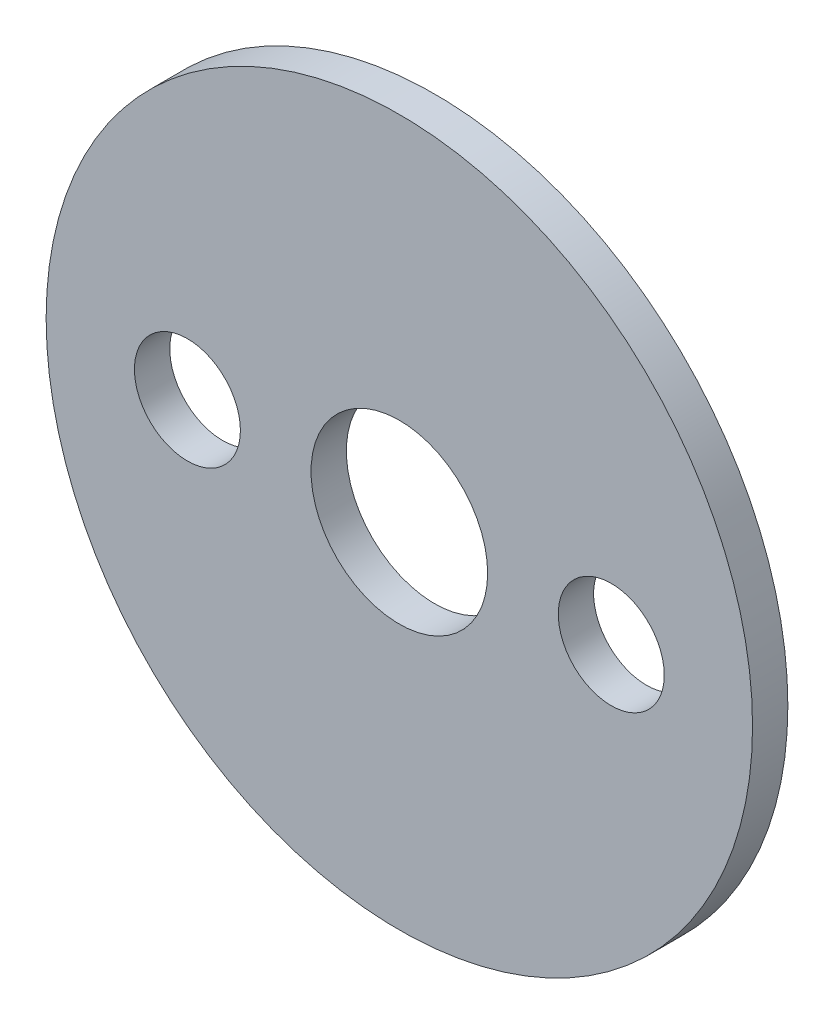
ISO-10303-21;
HEADER;
FILE_DESCRIPTION(('STEP AP214'),'2;1');
FILE_NAME('part.step','',(''),(''),'','','');
FILE_SCHEMA(('AUTOMOTIVE_DESIGN { 1 0 10303 214 1 1 1 1 }'));
ENDSEC;
DATA;
#1=APPLICATION_CONTEXT('core data for automotive mechanical design processes');
#2=APPLICATION_PROTOCOL_DEFINITION('international standard','automotive_design',2000,#1);
#3=PRODUCT_CONTEXT('',#1,'mechanical');
#4=PRODUCT('Part','Part','',(#3));
#5=PRODUCT_RELATED_PRODUCT_CATEGORY('part','',(#4));
#6=PRODUCT_DEFINITION_FORMATION('','',#4);
#7=PRODUCT_DEFINITION_CONTEXT('part definition',#1,'design');
#8=PRODUCT_DEFINITION('design','',#6,#7);
#9=PRODUCT_DEFINITION_SHAPE('','',#8);
#10=(LENGTH_UNIT() NAMED_UNIT(*) SI_UNIT(.MILLI.,.METRE.));
#11=(NAMED_UNIT(*) PLANE_ANGLE_UNIT() SI_UNIT($,.RADIAN.));
#12=(NAMED_UNIT(*) SI_UNIT($,.STERADIAN.) SOLID_ANGLE_UNIT());
#13=UNCERTAINTY_MEASURE_WITH_UNIT(LENGTH_MEASURE(1.E-05),#10,'distance_accuracy_value','');
#14=(GEOMETRIC_REPRESENTATION_CONTEXT(3) GLOBAL_UNCERTAINTY_ASSIGNED_CONTEXT((#13)) GLOBAL_UNIT_ASSIGNED_CONTEXT((#10,
#11,#12)) REPRESENTATION_CONTEXT('',''));
#15=CARTESIAN_POINT('',(0.,0.,0.));
#16=DIRECTION('',(0.,0.,1.));
#17=DIRECTION('',(1.,0.,0.));
#18=AXIS2_PLACEMENT_3D('',#15,#16,#17);
#19=CARTESIAN_POINT('',(0.,0.,0.25));
#20=DIRECTION('',(0.,0.,1.));
#21=DIRECTION('',(1.,0.,0.));
#22=AXIS2_PLACEMENT_3D('',#19,#20,#21);
#23=PLANE('',#22);
#24=CARTESIAN_POINT('',(-1.5,0.,0.25));
#25=DIRECTION('',(0.,0.,1.));
#26=DIRECTION('',(1.,0.,0.));
#27=AXIS2_PLACEMENT_3D('',#24,#25,#26);
#28=CIRCLE('',#27,0.375);
#29=CARTESIAN_POINT('',(-1.125,0.,0.25));
#30=VERTEX_POINT('',#29);
#31=EDGE_CURVE('E63',#30,#30,#28,.T.);
#32=ORIENTED_EDGE('',*,*,#31,.F.);
#33=EDGE_LOOP('',(#32));
#34=FACE_BOUND('',#33,.T.);
#35=CARTESIAN_POINT('',(1.5,0.,0.25));
#36=DIRECTION('',(0.,0.,1.));
#37=DIRECTION('',(1.,0.,0.));
#38=AXIS2_PLACEMENT_3D('',#35,#36,#37);
#39=CIRCLE('',#38,0.375);
#40=CARTESIAN_POINT('',(1.875,0.,0.25));
#41=VERTEX_POINT('',#40);
#42=EDGE_CURVE('E57',#41,#41,#39,.T.);
#43=ORIENTED_EDGE('',*,*,#42,.F.);
#44=EDGE_LOOP('',(#43));
#45=FACE_BOUND('',#44,.T.);
#46=CARTESIAN_POINT('',(0.,0.,0.25));
#47=DIRECTION('',(0.,0.,1.));
#48=DIRECTION('',(1.,0.,0.));
#49=AXIS2_PLACEMENT_3D('',#46,#47,#48);
#50=CIRCLE('',#49,2.5);
#51=CARTESIAN_POINT('',(2.5,0.,0.25));
#52=VERTEX_POINT('',#51);
#53=EDGE_CURVE('E10',#52,#52,#50,.T.);
#54=ORIENTED_EDGE('',*,*,#53,.T.);
#55=EDGE_LOOP('',(#54));
#56=FACE_BOUND('',#55,.T.);
#57=CARTESIAN_POINT('',(0.,0.,0.25));
#58=DIRECTION('',(0.,0.,1.));
#59=DIRECTION('',(1.,0.,0.));
#60=AXIS2_PLACEMENT_3D('',#57,#58,#59);
#61=CIRCLE('',#60,0.625);
#62=CARTESIAN_POINT('',(0.625,0.,0.25));
#63=VERTEX_POINT('',#62);
#64=EDGE_CURVE('E47',#63,#63,#61,.T.);
#65=ORIENTED_EDGE('',*,*,#64,.F.);
#66=EDGE_LOOP('',(#65));
#67=FACE_BOUND('',#66,.T.);
#68=ADVANCED_FACE('F36',(#34,#45,#56,#67),#23,.T.);
#69=CARTESIAN_POINT('',(0.,0.,0.));
#70=DIRECTION('',(0.,0.,1.));
#71=DIRECTION('',(1.,0.,0.));
#72=AXIS2_PLACEMENT_3D('',#69,#70,#71);
#73=PLANE('',#72);
#74=CARTESIAN_POINT('',(-1.5,0.,0.));
#75=DIRECTION('',(0.,0.,1.));
#76=DIRECTION('',(1.,0.,0.));
#77=AXIS2_PLACEMENT_3D('',#74,#75,#76);
#78=CIRCLE('',#77,0.375);
#79=CARTESIAN_POINT('',(-1.125,0.,0.));
#80=VERTEX_POINT('',#79);
#81=EDGE_CURVE('E60',#80,#80,#78,.T.);
#82=ORIENTED_EDGE('',*,*,#81,.T.);
#83=EDGE_LOOP('',(#82));
#84=FACE_BOUND('',#83,.T.);
#85=CARTESIAN_POINT('',(1.5,0.,0.));
#86=DIRECTION('',(0.,0.,1.));
#87=DIRECTION('',(1.,0.,0.));
#88=AXIS2_PLACEMENT_3D('',#85,#86,#87);
#89=CIRCLE('',#88,0.375);
#90=CARTESIAN_POINT('',(1.875,0.,0.));
#91=VERTEX_POINT('',#90);
#92=EDGE_CURVE('E52',#91,#91,#89,.T.);
#93=ORIENTED_EDGE('',*,*,#92,.T.);
#94=EDGE_LOOP('',(#93));
#95=FACE_BOUND('',#94,.T.);
#96=CARTESIAN_POINT('',(0.,0.,0.));
#97=DIRECTION('',(0.,0.,1.));
#98=DIRECTION('',(1.,0.,0.));
#99=AXIS2_PLACEMENT_3D('',#96,#97,#98);
#100=CIRCLE('',#99,2.5);
#101=CARTESIAN_POINT('',(2.5,0.,0.));
#102=VERTEX_POINT('',#101);
#103=EDGE_CURVE('E40',#102,#102,#100,.T.);
#104=ORIENTED_EDGE('',*,*,#103,.F.);
#105=EDGE_LOOP('',(#104));
#106=FACE_BOUND('',#105,.T.);
#107=CARTESIAN_POINT('',(0.,0.,0.));
#108=DIRECTION('',(0.,0.,1.));
#109=DIRECTION('',(1.,0.,0.));
#110=AXIS2_PLACEMENT_3D('',#107,#108,#109);
#111=CIRCLE('',#110,0.625);
#112=CARTESIAN_POINT('',(0.625,0.,0.));
#113=VERTEX_POINT('',#112);
#114=EDGE_CURVE('E49',#113,#113,#111,.T.);
#115=ORIENTED_EDGE('',*,*,#114,.T.);
#116=EDGE_LOOP('',(#115));
#117=FACE_BOUND('',#116,.T.);
#118=ADVANCED_FACE('F71',(#84,#95,#106,#117),#73,.F.);
#119=CARTESIAN_POINT('',(0.,0.,0.25));
#120=DIRECTION('',(0.,0.,-1.));
#121=DIRECTION('',(-1.,0.,0.));
#122=AXIS2_PLACEMENT_3D('',#119,#120,#121);
#123=CYLINDRICAL_SURFACE('',#122,2.5);
#124=ORIENTED_EDGE('',*,*,#53,.F.);
#125=EDGE_LOOP('',(#124));
#126=FACE_BOUND('',#125,.T.);
#127=ORIENTED_EDGE('',*,*,#103,.T.);
#128=EDGE_LOOP('',(#127));
#129=FACE_BOUND('',#128,.T.);
#130=ADVANCED_FACE('F38',(#126,#129),#123,.T.);
#131=CARTESIAN_POINT('',(0.,0.,0.25));
#132=DIRECTION('',(0.,0.,-1.));
#133=DIRECTION('',(-1.,0.,0.));
#134=AXIS2_PLACEMENT_3D('',#131,#132,#133);
#135=CYLINDRICAL_SURFACE('',#134,0.625);
#136=ORIENTED_EDGE('',*,*,#64,.T.);
#137=EDGE_LOOP('',(#136));
#138=FACE_BOUND('',#137,.T.);
#139=ORIENTED_EDGE('',*,*,#114,.F.);
#140=EDGE_LOOP('',(#139));
#141=FACE_BOUND('',#140,.T.);
#142=ADVANCED_FACE('F77',(#138,#141),#135,.F.);
#143=CARTESIAN_POINT('',(1.5,0.,0.25));
#144=DIRECTION('',(0.,0.,1.));
#145=DIRECTION('',(1.,0.,0.));
#146=AXIS2_PLACEMENT_3D('',#143,#144,#145);
#147=CYLINDRICAL_SURFACE('',#146,0.375);
#148=ORIENTED_EDGE('',*,*,#92,.F.);
#149=EDGE_LOOP('',(#148));
#150=FACE_BOUND('',#149,.T.);
#151=ORIENTED_EDGE('',*,*,#42,.T.);
#152=EDGE_LOOP('',(#151));
#153=FACE_BOUND('',#152,.T.);
#154=ADVANCED_FACE('F80',(#150,#153),#147,.F.);
#155=CARTESIAN_POINT('',(-1.5,0.,0.25));
#156=DIRECTION('',(0.,0.,1.));
#157=DIRECTION('',(1.,0.,0.));
#158=AXIS2_PLACEMENT_3D('',#155,#156,#157);
#159=CYLINDRICAL_SURFACE('',#158,0.375);
#160=ORIENTED_EDGE('',*,*,#81,.F.);
#161=EDGE_LOOP('',(#160));
#162=FACE_BOUND('',#161,.T.);
#163=ORIENTED_EDGE('',*,*,#31,.T.);
#164=EDGE_LOOP('',(#163));
#165=FACE_BOUND('',#164,.T.);
#166=ADVANCED_FACE('F67',(#162,#165),#159,.F.);
#167=CLOSED_SHELL('',(#68,#118,#130,#142,#154,#166));
#168=MANIFOLD_SOLID_BREP('B2',#167);
#169=ADVANCED_BREP_SHAPE_REPRESENTATION('',(#18,#168),#14);
#170=SHAPE_DEFINITION_REPRESENTATION(#9,#169);
ENDSEC;
END-ISO-10303-21;
